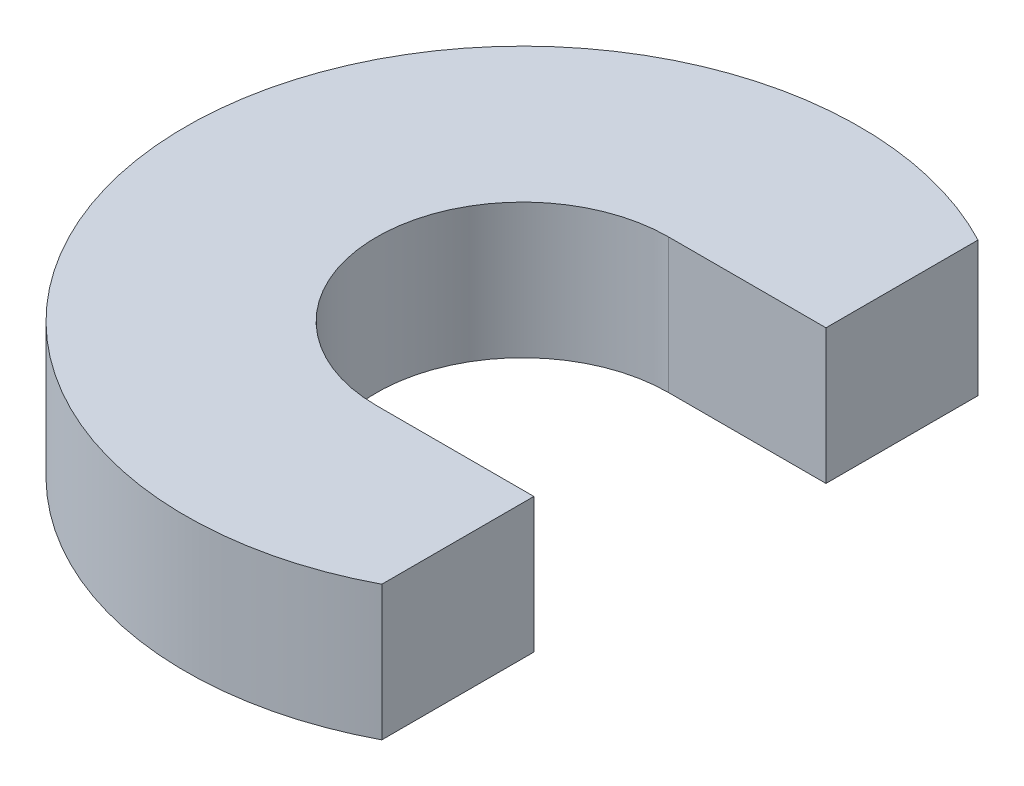
ISO-10303-21;
HEADER;
FILE_DESCRIPTION(('STEP AP214'),'2;1');
FILE_NAME('part.step','',(''),(''),'','','');
FILE_SCHEMA(('AUTOMOTIVE_DESIGN { 1 0 10303 214 1 1 1 1 }'));
ENDSEC;
DATA;
#1=APPLICATION_CONTEXT('core data for automotive mechanical design processes');
#2=APPLICATION_PROTOCOL_DEFINITION('international standard','automotive_design',2000,#1);
#3=PRODUCT_CONTEXT('',#1,'mechanical');
#4=PRODUCT('Part','Part','',(#3));
#5=PRODUCT_RELATED_PRODUCT_CATEGORY('part','',(#4));
#6=PRODUCT_DEFINITION_FORMATION('','',#4);
#7=PRODUCT_DEFINITION_CONTEXT('part definition',#1,'design');
#8=PRODUCT_DEFINITION('design','',#6,#7);
#9=PRODUCT_DEFINITION_SHAPE('','',#8);
#10=(LENGTH_UNIT() NAMED_UNIT(*) SI_UNIT(.MILLI.,.METRE.));
#11=(NAMED_UNIT(*) PLANE_ANGLE_UNIT() SI_UNIT($,.RADIAN.));
#12=(NAMED_UNIT(*) SI_UNIT($,.STERADIAN.) SOLID_ANGLE_UNIT());
#13=UNCERTAINTY_MEASURE_WITH_UNIT(LENGTH_MEASURE(1.E-05),#10,'distance_accuracy_value','');
#14=(GEOMETRIC_REPRESENTATION_CONTEXT(3) GLOBAL_UNCERTAINTY_ASSIGNED_CONTEXT((#13)) GLOBAL_UNIT_ASSIGNED_CONTEXT((#10,
#11,#12)) REPRESENTATION_CONTEXT('',''));
#15=CARTESIAN_POINT('',(0.,0.,0.));
#16=DIRECTION('',(0.,0.,1.));
#17=DIRECTION('',(1.,0.,0.));
#18=AXIS2_PLACEMENT_3D('',#15,#16,#17);
#19=CARTESIAN_POINT('',(0.,1.524,0.));
#20=DIRECTION('',(0.,-1.,0.));
#21=DIRECTION('',(0.,0.,-1.));
#22=AXIS2_PLACEMENT_3D('',#19,#20,#21);
#23=CYLINDRICAL_SURFACE('',#22,3.81);
#24=CARTESIAN_POINT('',(0.,0.,0.));
#25=DIRECTION('',(0.,1.,0.));
#26=DIRECTION('',(0.,0.,1.));
#27=AXIS2_PLACEMENT_3D('',#24,#25,#26);
#28=CIRCLE('',#27,3.81);
#29=CARTESIAN_POINT('',(1.778,0.,-3.36969078700109));
#30=VERTEX_POINT('',#29);
#31=CARTESIAN_POINT('',(1.778,0.,3.36969078700109));
#32=VERTEX_POINT('',#31);
#33=EDGE_CURVE('E129',#30,#32,#28,.T.);
#34=ORIENTED_EDGE('',*,*,#33,.T.);
#35=DIRECTION('',(0.,-1.,0.));
#36=VECTOR('',#35,1.);
#37=CARTESIAN_POINT('',(1.778,1.524,3.36969078700109));
#38=LINE('',#37,#36);
#39=CARTESIAN_POINT('',(1.778,1.524,3.36969078700109));
#40=VERTEX_POINT('',#39);
#41=EDGE_CURVE('E11',#40,#32,#38,.T.);
#42=ORIENTED_EDGE('',*,*,#41,.F.);
#43=CARTESIAN_POINT('',(0.,1.524,0.));
#44=DIRECTION('',(0.,1.,0.));
#45=DIRECTION('',(0.,0.,1.));
#46=AXIS2_PLACEMENT_3D('',#43,#44,#45);
#47=CIRCLE('',#46,3.81);
#48=CARTESIAN_POINT('',(1.778,1.524,-3.36969078700109));
#49=VERTEX_POINT('',#48);
#50=EDGE_CURVE('E139',#49,#40,#47,.T.);
#51=ORIENTED_EDGE('',*,*,#50,.F.);
#52=DIRECTION('',(0.,-1.,0.));
#53=VECTOR('',#52,1.);
#54=CARTESIAN_POINT('',(1.778,1.524,-3.36969078700109));
#55=LINE('',#54,#53);
#56=EDGE_CURVE('E125',#49,#30,#55,.T.);
#57=ORIENTED_EDGE('',*,*,#56,.T.);
#58=EDGE_LOOP('',(#34,#42,#51,#57));
#59=FACE_BOUND('',#58,.T.);
#60=ADVANCED_FACE('F45',(#59),#23,.T.);
#61=CARTESIAN_POINT('',(1.778,1.524,3.36969078700109));
#62=DIRECTION('',(-1.,0.,0.));
#63=DIRECTION('',(0.,0.,1.));
#64=AXIS2_PLACEMENT_3D('',#61,#62,#63);
#65=PLANE('',#64);
#66=DIRECTION('',(0.,0.,-1.));
#67=VECTOR('',#66,1.);
#68=CARTESIAN_POINT('',(1.778,0.,3.36969078700109));
#69=LINE('',#68,#67);
#70=CARTESIAN_POINT('',(1.778,0.,1.651));
#71=VERTEX_POINT('',#70);
#72=EDGE_CURVE('E132',#32,#71,#69,.T.);
#73=ORIENTED_EDGE('',*,*,#72,.T.);
#74=DIRECTION('',(0.,-1.,0.));
#75=VECTOR('',#74,1.);
#76=CARTESIAN_POINT('',(1.778,1.524,1.651));
#77=LINE('',#76,#75);
#78=CARTESIAN_POINT('',(1.778,1.524,1.651));
#79=VERTEX_POINT('',#78);
#80=EDGE_CURVE('E53',#79,#71,#77,.T.);
#81=ORIENTED_EDGE('',*,*,#80,.F.);
#82=DIRECTION('',(0.,0.,-1.));
#83=VECTOR('',#82,1.);
#84=CARTESIAN_POINT('',(1.778,1.524,3.36969078700109));
#85=LINE('',#84,#83);
#86=EDGE_CURVE('E98',#40,#79,#85,.T.);
#87=ORIENTED_EDGE('',*,*,#86,.F.);
#88=ORIENTED_EDGE('',*,*,#41,.T.);
#89=EDGE_LOOP('',(#73,#81,#87,#88));
#90=FACE_BOUND('',#89,.T.);
#91=ADVANCED_FACE('F165',(#90),#65,.F.);
#92=CARTESIAN_POINT('',(0.,1.524,1.651));
#93=DIRECTION('',(0.,0.,1.));
#94=DIRECTION('',(1.,0.,0.));
#95=AXIS2_PLACEMENT_3D('',#92,#93,#94);
#96=PLANE('',#95);
#97=DIRECTION('',(-1.,0.,0.));
#98=VECTOR('',#97,1.);
#99=CARTESIAN_POINT('',(0.,0.,1.651));
#100=LINE('',#99,#98);
#101=CARTESIAN_POINT('',(0.,0.,1.651));
#102=VERTEX_POINT('',#101);
#103=EDGE_CURVE('E134',#71,#102,#100,.T.);
#104=ORIENTED_EDGE('',*,*,#103,.T.);
#105=DIRECTION('',(0.,-1.,0.));
#106=VECTOR('',#105,1.);
#107=CARTESIAN_POINT('',(0.,1.524,1.651));
#108=LINE('',#107,#106);
#109=CARTESIAN_POINT('',(0.,1.524,1.651));
#110=VERTEX_POINT('',#109);
#111=EDGE_CURVE('E120',#110,#102,#108,.T.);
#112=ORIENTED_EDGE('',*,*,#111,.F.);
#113=DIRECTION('',(-1.,0.,0.));
#114=VECTOR('',#113,1.);
#115=CARTESIAN_POINT('',(0.,1.524,1.651));
#116=LINE('',#115,#114);
#117=EDGE_CURVE('E111',#79,#110,#116,.T.);
#118=ORIENTED_EDGE('',*,*,#117,.F.);
#119=ORIENTED_EDGE('',*,*,#80,.T.);
#120=EDGE_LOOP('',(#104,#112,#118,#119));
#121=FACE_BOUND('',#120,.T.);
#122=ADVANCED_FACE('F145',(#121),#96,.F.);
#123=CARTESIAN_POINT('',(0.,1.524,0.));
#124=DIRECTION('',(0.,-1.,0.));
#125=DIRECTION('',(0.,0.,-1.));
#126=AXIS2_PLACEMENT_3D('',#123,#124,#125);
#127=CYLINDRICAL_SURFACE('',#126,1.651);
#128=CARTESIAN_POINT('',(0.,0.,0.));
#129=DIRECTION('',(0.,-1.,0.));
#130=DIRECTION('',(0.,0.,1.));
#131=AXIS2_PLACEMENT_3D('',#128,#129,#130);
#132=CIRCLE('',#131,1.651);
#133=CARTESIAN_POINT('',(0.,0.,-1.651));
#134=VERTEX_POINT('',#133);
#135=EDGE_CURVE('E119',#102,#134,#132,.T.);
#136=ORIENTED_EDGE('',*,*,#135,.T.);
#137=DIRECTION('',(0.,-1.,0.));
#138=VECTOR('',#137,1.);
#139=CARTESIAN_POINT('',(0.,1.524,-1.651));
#140=LINE('',#139,#138);
#141=CARTESIAN_POINT('',(0.,1.524,-1.651));
#142=VERTEX_POINT('',#141);
#143=EDGE_CURVE('E116',#142,#134,#140,.T.);
#144=ORIENTED_EDGE('',*,*,#143,.F.);
#145=CARTESIAN_POINT('',(0.,1.524,0.));
#146=DIRECTION('',(0.,-1.,0.));
#147=DIRECTION('',(0.,0.,1.));
#148=AXIS2_PLACEMENT_3D('',#145,#146,#147);
#149=CIRCLE('',#148,1.651);
#150=EDGE_CURVE('E105',#110,#142,#149,.T.);
#151=ORIENTED_EDGE('',*,*,#150,.F.);
#152=ORIENTED_EDGE('',*,*,#111,.T.);
#153=EDGE_LOOP('',(#136,#144,#151,#152));
#154=FACE_BOUND('',#153,.T.);
#155=ADVANCED_FACE('F117',(#154),#127,.F.);
#156=CARTESIAN_POINT('',(0.,1.524,-1.651));
#157=DIRECTION('',(0.,0.,-1.));
#158=DIRECTION('',(-1.,0.,0.));
#159=AXIS2_PLACEMENT_3D('',#156,#157,#158);
#160=PLANE('',#159);
#161=DIRECTION('',(1.,0.,0.));
#162=VECTOR('',#161,1.);
#163=CARTESIAN_POINT('',(0.,0.,-1.651));
#164=LINE('',#163,#162);
#165=CARTESIAN_POINT('',(1.778,0.,-1.651));
#166=VERTEX_POINT('',#165);
#167=EDGE_CURVE('E84',#134,#166,#164,.T.);
#168=ORIENTED_EDGE('',*,*,#167,.T.);
#169=DIRECTION('',(0.,-1.,0.));
#170=VECTOR('',#169,1.);
#171=CARTESIAN_POINT('',(1.778,1.524,-1.651));
#172=LINE('',#171,#170);
#173=CARTESIAN_POINT('',(1.778,1.524,-1.651));
#174=VERTEX_POINT('',#173);
#175=EDGE_CURVE('E121',#174,#166,#172,.T.);
#176=ORIENTED_EDGE('',*,*,#175,.F.);
#177=DIRECTION('',(1.,0.,0.));
#178=VECTOR('',#177,1.);
#179=CARTESIAN_POINT('',(0.,1.524,-1.651));
#180=LINE('',#179,#178);
#181=EDGE_CURVE('E109',#142,#174,#180,.T.);
#182=ORIENTED_EDGE('',*,*,#181,.F.);
#183=ORIENTED_EDGE('',*,*,#143,.T.);
#184=EDGE_LOOP('',(#168,#176,#182,#183));
#185=FACE_BOUND('',#184,.T.);
#186=ADVANCED_FACE('F123',(#185),#160,.F.);
#187=CARTESIAN_POINT('',(1.778,1.524,-1.651));
#188=DIRECTION('',(-1.,0.,0.));
#189=DIRECTION('',(0.,0.,1.));
#190=AXIS2_PLACEMENT_3D('',#187,#188,#189);
#191=PLANE('',#190);
#192=DIRECTION('',(0.,0.,-1.));
#193=VECTOR('',#192,1.);
#194=CARTESIAN_POINT('',(1.778,0.,-1.651));
#195=LINE('',#194,#193);
#196=EDGE_CURVE('E90',#166,#30,#195,.T.);
#197=ORIENTED_EDGE('',*,*,#196,.T.);
#198=ORIENTED_EDGE('',*,*,#56,.F.);
#199=DIRECTION('',(0.,0.,-1.));
#200=VECTOR('',#199,1.);
#201=CARTESIAN_POINT('',(1.778,1.524,-1.651));
#202=LINE('',#201,#200);
#203=EDGE_CURVE('E61',#174,#49,#202,.T.);
#204=ORIENTED_EDGE('',*,*,#203,.F.);
#205=ORIENTED_EDGE('',*,*,#175,.T.);
#206=EDGE_LOOP('',(#197,#198,#204,#205));
#207=FACE_BOUND('',#206,.T.);
#208=ADVANCED_FACE('F152',(#207),#191,.F.);
#209=CARTESIAN_POINT('',(0.,1.524,0.));
#210=DIRECTION('',(0.,1.,0.));
#211=DIRECTION('',(0.,0.,1.));
#212=AXIS2_PLACEMENT_3D('',#209,#210,#211);
#213=PLANE('',#212);
#214=ORIENTED_EDGE('',*,*,#50,.T.);
#215=ORIENTED_EDGE('',*,*,#86,.T.);
#216=ORIENTED_EDGE('',*,*,#117,.T.);
#217=ORIENTED_EDGE('',*,*,#150,.T.);
#218=ORIENTED_EDGE('',*,*,#181,.T.);
#219=ORIENTED_EDGE('',*,*,#203,.T.);
#220=EDGE_LOOP('',(#214,#215,#216,#217,#218,#219));
#221=FACE_BOUND('',#220,.T.);
#222=ADVANCED_FACE('F107',(#221),#213,.T.);
#223=CARTESIAN_POINT('',(0.,0.,0.));
#224=DIRECTION('',(0.,1.,0.));
#225=DIRECTION('',(0.,0.,1.));
#226=AXIS2_PLACEMENT_3D('',#223,#224,#225);
#227=PLANE('',#226);
#228=ORIENTED_EDGE('',*,*,#33,.F.);
#229=ORIENTED_EDGE('',*,*,#196,.F.);
#230=ORIENTED_EDGE('',*,*,#167,.F.);
#231=ORIENTED_EDGE('',*,*,#135,.F.);
#232=ORIENTED_EDGE('',*,*,#103,.F.);
#233=ORIENTED_EDGE('',*,*,#72,.F.);
#234=EDGE_LOOP('',(#228,#229,#230,#231,#232,#233));
#235=FACE_BOUND('',#234,.T.);
#236=ADVANCED_FACE('F148',(#235),#227,.F.);
#237=CLOSED_SHELL('',(#60,#91,#122,#155,#186,#208,#222,#236));
#238=MANIFOLD_SOLID_BREP('B2',#237);
#239=ADVANCED_BREP_SHAPE_REPRESENTATION('',(#18,#238),#14);
#240=SHAPE_DEFINITION_REPRESENTATION(#9,#239);
ENDSEC;
END-ISO-10303-21;
